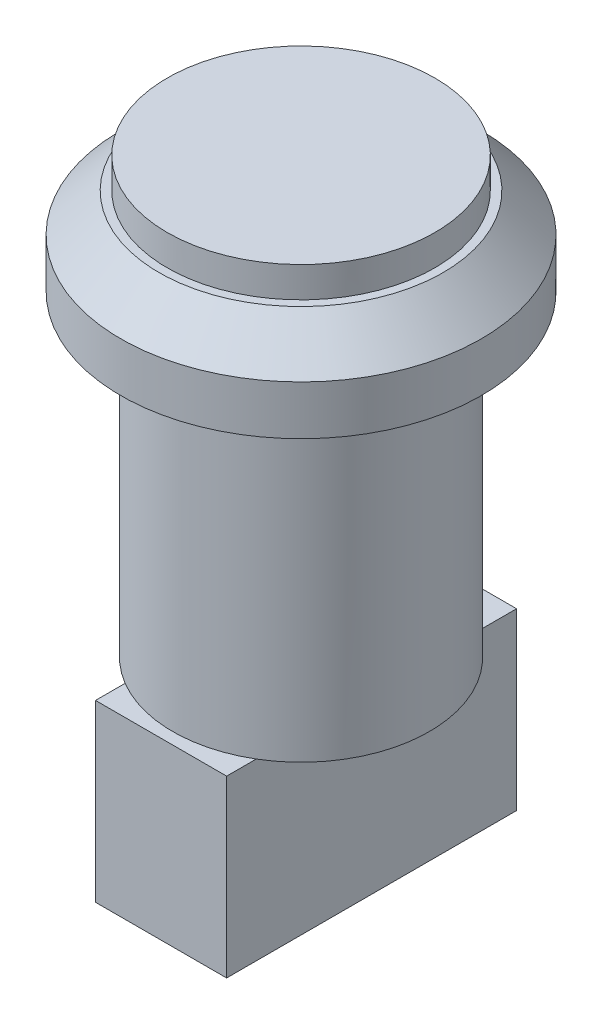
ISO-10303-21;
HEADER;
FILE_DESCRIPTION(('STEP AP214'),'2;1');
FILE_NAME('part.step','',(''),(''),'','','');
FILE_SCHEMA(('AUTOMOTIVE_DESIGN { 1 0 10303 214 1 1 1 1 }'));
ENDSEC;
DATA;
#1=APPLICATION_CONTEXT('core data for automotive mechanical design processes');
#2=APPLICATION_PROTOCOL_DEFINITION('international standard','automotive_design',2000,#1);
#3=PRODUCT_CONTEXT('',#1,'mechanical');
#4=PRODUCT('Part','Part','',(#3));
#5=PRODUCT_RELATED_PRODUCT_CATEGORY('part','',(#4));
#6=PRODUCT_DEFINITION_FORMATION('','',#4);
#7=PRODUCT_DEFINITION_CONTEXT('part definition',#1,'design');
#8=PRODUCT_DEFINITION('design','',#6,#7);
#9=PRODUCT_DEFINITION_SHAPE('','',#8);
#10=(LENGTH_UNIT() NAMED_UNIT(*) SI_UNIT(.MILLI.,.METRE.));
#11=(NAMED_UNIT(*) PLANE_ANGLE_UNIT() SI_UNIT($,.RADIAN.));
#12=(NAMED_UNIT(*) SI_UNIT($,.STERADIAN.) SOLID_ANGLE_UNIT());
#13=UNCERTAINTY_MEASURE_WITH_UNIT(LENGTH_MEASURE(1.E-05),#10,'distance_accuracy_value','');
#14=(GEOMETRIC_REPRESENTATION_CONTEXT(3) GLOBAL_UNCERTAINTY_ASSIGNED_CONTEXT((#13)) GLOBAL_UNIT_ASSIGNED_CONTEXT((#10,
#11,#12)) REPRESENTATION_CONTEXT('',''));
#15=CARTESIAN_POINT('',(0.,0.,0.));
#16=DIRECTION('',(0.,0.,1.));
#17=DIRECTION('',(1.,0.,0.));
#18=AXIS2_PLACEMENT_3D('',#15,#16,#17);
#19=CARTESIAN_POINT('',(0.,-37.,0.));
#20=DIRECTION('',(0.,-1.,0.));
#21=DIRECTION('',(0.,0.,-1.));
#22=AXIS2_PLACEMENT_3D('',#19,#20,#21);
#23=PLANE('',#22);
#24=DIRECTION('',(0.,0.,-1.));
#25=VECTOR('',#24,1.);
#26=CARTESIAN_POINT('',(-6.,-37.,12.8118333096289));
#27=LINE('',#26,#25);
#28=CARTESIAN_POINT('',(-6.,-37.,10.1025986755884));
#29=VERTEX_POINT('',#28);
#30=CARTESIAN_POINT('',(-6.,-37.,-10.1025986755884));
#31=VERTEX_POINT('',#30);
#32=EDGE_CURVE('E11',#29,#31,#27,.T.);
#33=ORIENTED_EDGE('',*,*,#32,.F.);
#34=CARTESIAN_POINT('',(0.,-37.,0.));
#35=DIRECTION('',(0.,-1.,0.));
#36=DIRECTION('',(0.,0.,-1.));
#37=AXIS2_PLACEMENT_3D('',#34,#35,#36);
#38=CIRCLE('',#37,11.75);
#39=EDGE_CURVE('E166',#29,#31,#38,.T.);
#40=ORIENTED_EDGE('',*,*,#39,.T.);
#41=EDGE_LOOP('',(#33,#40));
#42=FACE_BOUND('',#41,.T.);
#43=ADVANCED_FACE('F34',(#42),#23,.T.);
#44=CARTESIAN_POINT('',(0.,2.8,0.));
#45=DIRECTION('',(0.,-1.,0.));
#46=DIRECTION('',(0.,0.,-1.));
#47=AXIS2_PLACEMENT_3D('',#44,#45,#46);
#48=CYLINDRICAL_SURFACE('',#47,12.25);
#49=CARTESIAN_POINT('',(0.,2.8,0.));
#50=DIRECTION('',(0.,1.,0.));
#51=DIRECTION('',(0.,0.,1.));
#52=AXIS2_PLACEMENT_3D('',#49,#50,#51);
#53=CIRCLE('',#52,12.25);
#54=CARTESIAN_POINT('',(0.,2.8,12.25));
#55=VERTEX_POINT('',#54);
#56=EDGE_CURVE('E132',#55,#55,#53,.T.);
#57=ORIENTED_EDGE('',*,*,#56,.F.);
#58=EDGE_LOOP('',(#57));
#59=FACE_BOUND('',#58,.T.);
#60=CARTESIAN_POINT('',(0.,0.,0.));
#61=DIRECTION('',(0.,-1.,0.));
#62=DIRECTION('',(0.,0.,-1.));
#63=AXIS2_PLACEMENT_3D('',#60,#61,#62);
#64=CIRCLE('',#63,12.25);
#65=CARTESIAN_POINT('',(0.,0.,-12.25));
#66=VERTEX_POINT('',#65);
#67=EDGE_CURVE('E129',#66,#66,#64,.T.);
#68=ORIENTED_EDGE('',*,*,#67,.F.);
#69=EDGE_LOOP('',(#68));
#70=FACE_BOUND('',#69,.T.);
#71=ADVANCED_FACE('F181',(#59,#70),#48,.T.);
#72=CARTESIAN_POINT('',(0.,2.8,0.));
#73=DIRECTION('',(0.,1.,0.));
#74=DIRECTION('',(0.,0.,1.));
#75=AXIS2_PLACEMENT_3D('',#72,#73,#74);
#76=PLANE('',#75);
#77=ORIENTED_EDGE('',*,*,#56,.T.);
#78=EDGE_LOOP('',(#77));
#79=FACE_BOUND('',#78,.T.);
#80=ADVANCED_FACE('F186',(#79),#76,.T.);
#81=CARTESIAN_POINT('',(0.,-8.,0.));
#82=DIRECTION('',(0.,1.,0.));
#83=DIRECTION('',(0.,0.,1.));
#84=AXIS2_PLACEMENT_3D('',#81,#82,#83);
#85=CYLINDRICAL_SURFACE('',#84,16.5);
#86=CARTESIAN_POINT('',(0.,-3.5,0.));
#87=DIRECTION('',(0.,-1.,0.));
#88=DIRECTION('',(0.,0.,-1.));
#89=AXIS2_PLACEMENT_3D('',#86,#87,#88);
#90=CIRCLE('',#89,16.5);
#91=CARTESIAN_POINT('',(0.,-3.5,-16.5));
#92=VERTEX_POINT('',#91);
#93=EDGE_CURVE('E134',#92,#92,#90,.T.);
#94=ORIENTED_EDGE('',*,*,#93,.T.);
#95=EDGE_LOOP('',(#94));
#96=FACE_BOUND('',#95,.T.);
#97=CARTESIAN_POINT('',(0.,-8.,0.));
#98=DIRECTION('',(0.,-1.,0.));
#99=DIRECTION('',(0.,0.,-1.));
#100=AXIS2_PLACEMENT_3D('',#97,#98,#99);
#101=CIRCLE('',#100,16.5);
#102=CARTESIAN_POINT('',(0.,-8.,-16.5));
#103=VERTEX_POINT('',#102);
#104=EDGE_CURVE('E124',#103,#103,#101,.T.);
#105=ORIENTED_EDGE('',*,*,#104,.F.);
#106=EDGE_LOOP('',(#105));
#107=FACE_BOUND('',#106,.T.);
#108=ADVANCED_FACE('F202',(#96,#107),#85,.T.);
#109=CARTESIAN_POINT('',(0.,-8.,0.));
#110=DIRECTION('',(0.,-1.,0.));
#111=DIRECTION('',(0.,0.,-1.));
#112=AXIS2_PLACEMENT_3D('',#109,#110,#111);
#113=PLANE('',#112);
#114=CARTESIAN_POINT('',(0.,-8.,0.));
#115=DIRECTION('',(0.,-1.,0.));
#116=DIRECTION('',(0.,0.,-1.));
#117=AXIS2_PLACEMENT_3D('',#114,#115,#116);
#118=CIRCLE('',#117,11.75);
#119=CARTESIAN_POINT('',(0.,-8.,-11.75));
#120=VERTEX_POINT('',#119);
#121=EDGE_CURVE('E115',#120,#120,#118,.T.);
#122=ORIENTED_EDGE('',*,*,#121,.F.);
#123=EDGE_LOOP('',(#122));
#124=FACE_BOUND('',#123,.T.);
#125=ORIENTED_EDGE('',*,*,#104,.T.);
#126=EDGE_LOOP('',(#125));
#127=FACE_BOUND('',#126,.T.);
#128=ADVANCED_FACE('F198',(#124,#127),#113,.T.);
#129=CARTESIAN_POINT('',(0.,0.,0.));
#130=DIRECTION('',(0.,-1.,0.));
#131=DIRECTION('',(0.,0.,-1.));
#132=AXIS2_PLACEMENT_3D('',#129,#130,#131);
#133=PLANE('',#132);
#134=CARTESIAN_POINT('',(0.,0.,0.));
#135=DIRECTION('',(0.,-1.,0.));
#136=DIRECTION('',(0.,0.,-1.));
#137=AXIS2_PLACEMENT_3D('',#134,#135,#136);
#138=CIRCLE('',#137,13.);
#139=CARTESIAN_POINT('',(0.,0.,-13.));
#140=VERTEX_POINT('',#139);
#141=EDGE_CURVE('E38',#140,#140,#138,.F.);
#142=ORIENTED_EDGE('',*,*,#141,.T.);
#143=EDGE_LOOP('',(#142));
#144=FACE_BOUND('',#143,.T.);
#145=ORIENTED_EDGE('',*,*,#67,.T.);
#146=EDGE_LOOP('',(#145));
#147=FACE_BOUND('',#146,.T.);
#148=ADVANCED_FACE('F201',(#144,#147),#133,.F.);
#149=CARTESIAN_POINT('',(0.,-3.5,0.));
#150=DIRECTION('',(0.,-1.,0.));
#151=DIRECTION('',(0.,0.,-1.));
#152=AXIS2_PLACEMENT_3D('',#149,#150,#151);
#153=CONICAL_SURFACE('',#152,16.5,0.78539816339745);
#154=ORIENTED_EDGE('',*,*,#141,.F.);
#155=EDGE_LOOP('',(#154));
#156=FACE_BOUND('',#155,.T.);
#157=ORIENTED_EDGE('',*,*,#93,.F.);
#158=EDGE_LOOP('',(#157));
#159=FACE_BOUND('',#158,.T.);
#160=ADVANCED_FACE('F36',(#156,#159),#153,.T.);
#161=CARTESIAN_POINT('',(0.,-37.,0.));
#162=DIRECTION('',(0.,1.,0.));
#163=DIRECTION('',(0.,0.,1.));
#164=AXIS2_PLACEMENT_3D('',#161,#162,#163);
#165=CYLINDRICAL_SURFACE('',#164,11.75);
#166=CARTESIAN_POINT('',(6.,-37.,-10.1025986755884));
#167=VERTEX_POINT('',#166);
#168=CARTESIAN_POINT('',(6.,-37.,10.1025986755884));
#169=VERTEX_POINT('',#168);
#170=EDGE_CURVE('E123',#167,#169,#38,.T.);
#171=ORIENTED_EDGE('',*,*,#170,.F.);
#172=EDGE_CURVE('E53',#31,#167,#38,.T.);
#173=ORIENTED_EDGE('',*,*,#172,.F.);
#174=ORIENTED_EDGE('',*,*,#39,.F.);
#175=EDGE_CURVE('E125',#169,#29,#38,.T.);
#176=ORIENTED_EDGE('',*,*,#175,.F.);
#177=EDGE_LOOP('',(#171,#173,#174,#176));
#178=FACE_BOUND('',#177,.T.);
#179=ORIENTED_EDGE('',*,*,#121,.T.);
#180=EDGE_LOOP('',(#179));
#181=FACE_BOUND('',#180,.T.);
#182=ADVANCED_FACE('F190',(#178,#181),#165,.T.);
#183=DIRECTION('',(0.,0.,1.));
#184=VECTOR('',#183,1.);
#185=CARTESIAN_POINT('',(6.,-37.,12.8118333096289));
#186=LINE('',#185,#184);
#187=EDGE_CURVE('E43',#167,#169,#186,.T.);
#188=ORIENTED_EDGE('',*,*,#187,.F.);
#189=ORIENTED_EDGE('',*,*,#170,.T.);
#190=EDGE_LOOP('',(#188,#189));
#191=FACE_BOUND('',#190,.T.);
#192=ADVANCED_FACE('F177',(#191),#23,.T.);
#193=CARTESIAN_POINT('',(0.,-37.,0.));
#194=DIRECTION('',(0.,-1.,0.));
#195=DIRECTION('',(0.,0.,-1.));
#196=AXIS2_PLACEMENT_3D('',#193,#194,#195);
#197=PLANE('',#196);
#198=CARTESIAN_POINT('',(6.,-37.,12.8118333096289));
#199=VERTEX_POINT('',#198);
#200=EDGE_CURVE('E144',#169,#199,#186,.T.);
#201=ORIENTED_EDGE('',*,*,#200,.F.);
#202=ORIENTED_EDGE('',*,*,#175,.T.);
#203=CARTESIAN_POINT('',(-6.,-37.,12.8118333096289));
#204=VERTEX_POINT('',#203);
#205=EDGE_CURVE('E45',#204,#29,#27,.T.);
#206=ORIENTED_EDGE('',*,*,#205,.F.);
#207=DIRECTION('',(-1.,0.,0.));
#208=VECTOR('',#207,1.);
#209=CARTESIAN_POINT('',(-6.,-37.,12.8118333096289));
#210=LINE('',#209,#208);
#211=EDGE_CURVE('E109',#199,#204,#210,.T.);
#212=ORIENTED_EDGE('',*,*,#211,.F.);
#213=EDGE_LOOP('',(#201,#202,#206,#212));
#214=FACE_BOUND('',#213,.T.);
#215=ADVANCED_FACE('F164',(#214),#197,.F.);
#216=CARTESIAN_POINT('',(-6.,-37.,-13.7220878964584));
#217=VERTEX_POINT('',#216);
#218=EDGE_CURVE('E46',#31,#217,#27,.T.);
#219=ORIENTED_EDGE('',*,*,#218,.F.);
#220=ORIENTED_EDGE('',*,*,#172,.T.);
#221=CARTESIAN_POINT('',(6.,-37.,-13.7220878964584));
#222=VERTEX_POINT('',#221);
#223=EDGE_CURVE('E143',#222,#167,#186,.T.);
#224=ORIENTED_EDGE('',*,*,#223,.F.);
#225=DIRECTION('',(1.,0.,0.));
#226=VECTOR('',#225,1.);
#227=CARTESIAN_POINT('',(-6.,-37.,-13.7220878964584));
#228=LINE('',#227,#226);
#229=EDGE_CURVE('E149',#217,#222,#228,.T.);
#230=ORIENTED_EDGE('',*,*,#229,.F.);
#231=EDGE_LOOP('',(#219,#220,#224,#230));
#232=FACE_BOUND('',#231,.T.);
#233=ADVANCED_FACE('F169',(#232),#197,.F.);
#234=CARTESIAN_POINT('',(-6.,-53.,12.8118333096289));
#235=DIRECTION('',(1.,0.,0.));
#236=DIRECTION('',(0.,0.,-1.));
#237=AXIS2_PLACEMENT_3D('',#234,#235,#236);
#238=PLANE('',#237);
#239=ORIENTED_EDGE('',*,*,#205,.T.);
#240=ORIENTED_EDGE('',*,*,#32,.T.);
#241=ORIENTED_EDGE('',*,*,#218,.T.);
#242=DIRECTION('',(0.,1.,0.));
#243=VECTOR('',#242,1.);
#244=CARTESIAN_POINT('',(-6.,-53.,-13.7220878964584));
#245=LINE('',#244,#243);
#246=CARTESIAN_POINT('',(-6.,-53.,-13.7220878964584));
#247=VERTEX_POINT('',#246);
#248=EDGE_CURVE('E94',#247,#217,#245,.T.);
#249=ORIENTED_EDGE('',*,*,#248,.F.);
#250=DIRECTION('',(0.,0.,-1.));
#251=VECTOR('',#250,1.);
#252=CARTESIAN_POINT('',(-6.,-53.,12.8118333096289));
#253=LINE('',#252,#251);
#254=CARTESIAN_POINT('',(-6.,-53.,12.8118333096289));
#255=VERTEX_POINT('',#254);
#256=EDGE_CURVE('E100',#255,#247,#253,.T.);
#257=ORIENTED_EDGE('',*,*,#256,.F.);
#258=DIRECTION('',(0.,1.,0.));
#259=VECTOR('',#258,1.);
#260=CARTESIAN_POINT('',(-6.,-53.,12.8118333096289));
#261=LINE('',#260,#259);
#262=EDGE_CURVE('E155',#255,#204,#261,.T.);
#263=ORIENTED_EDGE('',*,*,#262,.T.);
#264=EDGE_LOOP('',(#239,#240,#241,#249,#257,#263));
#265=FACE_BOUND('',#264,.T.);
#266=ADVANCED_FACE('F112',(#265),#238,.F.);
#267=CARTESIAN_POINT('',(-6.,-53.,-13.7220878964584));
#268=DIRECTION('',(0.,0.,1.));
#269=DIRECTION('',(1.,0.,0.));
#270=AXIS2_PLACEMENT_3D('',#267,#268,#269);
#271=PLANE('',#270);
#272=ORIENTED_EDGE('',*,*,#229,.T.);
#273=DIRECTION('',(0.,1.,0.));
#274=VECTOR('',#273,1.);
#275=CARTESIAN_POINT('',(6.,-53.,-13.7220878964584));
#276=LINE('',#275,#274);
#277=CARTESIAN_POINT('',(6.,-53.,-13.7220878964584));
#278=VERTEX_POINT('',#277);
#279=EDGE_CURVE('E96',#278,#222,#276,.T.);
#280=ORIENTED_EDGE('',*,*,#279,.F.);
#281=DIRECTION('',(1.,0.,0.));
#282=VECTOR('',#281,1.);
#283=CARTESIAN_POINT('',(-6.,-53.,-13.7220878964584));
#284=LINE('',#283,#282);
#285=EDGE_CURVE('E90',#247,#278,#284,.T.);
#286=ORIENTED_EDGE('',*,*,#285,.F.);
#287=ORIENTED_EDGE('',*,*,#248,.T.);
#288=EDGE_LOOP('',(#272,#280,#286,#287));
#289=FACE_BOUND('',#288,.T.);
#290=ADVANCED_FACE('F92',(#289),#271,.F.);
#291=CARTESIAN_POINT('',(6.,-53.,12.8118333096289));
#292=DIRECTION('',(-1.,0.,0.));
#293=DIRECTION('',(0.,0.,1.));
#294=AXIS2_PLACEMENT_3D('',#291,#292,#293);
#295=PLANE('',#294);
#296=ORIENTED_EDGE('',*,*,#223,.T.);
#297=ORIENTED_EDGE('',*,*,#187,.T.);
#298=ORIENTED_EDGE('',*,*,#200,.T.);
#299=DIRECTION('',(0.,1.,0.));
#300=VECTOR('',#299,1.);
#301=CARTESIAN_POINT('',(6.,-53.,12.8118333096289));
#302=LINE('',#301,#300);
#303=CARTESIAN_POINT('',(6.,-53.,12.8118333096289));
#304=VERTEX_POINT('',#303);
#305=EDGE_CURVE('E119',#304,#199,#302,.T.);
#306=ORIENTED_EDGE('',*,*,#305,.F.);
#307=DIRECTION('',(0.,0.,1.));
#308=VECTOR('',#307,1.);
#309=CARTESIAN_POINT('',(6.,-53.,12.8118333096289));
#310=LINE('',#309,#308);
#311=EDGE_CURVE('E99',#278,#304,#310,.T.);
#312=ORIENTED_EDGE('',*,*,#311,.F.);
#313=ORIENTED_EDGE('',*,*,#279,.T.);
#314=EDGE_LOOP('',(#296,#297,#298,#306,#312,#313));
#315=FACE_BOUND('',#314,.T.);
#316=ADVANCED_FACE('F156',(#315),#295,.F.);
#317=CARTESIAN_POINT('',(-6.,-53.,12.8118333096289));
#318=DIRECTION('',(0.,0.,-1.));
#319=DIRECTION('',(-1.,0.,0.));
#320=AXIS2_PLACEMENT_3D('',#317,#318,#319);
#321=PLANE('',#320);
#322=ORIENTED_EDGE('',*,*,#211,.T.);
#323=ORIENTED_EDGE('',*,*,#262,.F.);
#324=DIRECTION('',(-1.,0.,0.));
#325=VECTOR('',#324,1.);
#326=CARTESIAN_POINT('',(-6.,-53.,12.8118333096289));
#327=LINE('',#326,#325);
#328=EDGE_CURVE('E105',#304,#255,#327,.T.);
#329=ORIENTED_EDGE('',*,*,#328,.F.);
#330=ORIENTED_EDGE('',*,*,#305,.T.);
#331=EDGE_LOOP('',(#322,#323,#329,#330));
#332=FACE_BOUND('',#331,.T.);
#333=ADVANCED_FACE('F159',(#332),#321,.F.);
#334=CARTESIAN_POINT('',(0.,-53.,0.));
#335=DIRECTION('',(0.,-1.,0.));
#336=DIRECTION('',(0.,0.,-1.));
#337=AXIS2_PLACEMENT_3D('',#334,#335,#336);
#338=PLANE('',#337);
#339=ORIENTED_EDGE('',*,*,#256,.T.);
#340=ORIENTED_EDGE('',*,*,#285,.T.);
#341=ORIENTED_EDGE('',*,*,#311,.T.);
#342=ORIENTED_EDGE('',*,*,#328,.T.);
#343=EDGE_LOOP('',(#339,#340,#341,#342));
#344=FACE_BOUND('',#343,.T.);
#345=ADVANCED_FACE('F103',(#344),#338,.T.);
#346=CLOSED_SHELL('',(#43,#71,#80,#108,#128,#148,#160,#182,#192,#215,#233,#266,#290,#316,#333,#345));
#347=MANIFOLD_SOLID_BREP('B2',#346);
#348=ADVANCED_BREP_SHAPE_REPRESENTATION('',(#18,#347),#14);
#349=SHAPE_DEFINITION_REPRESENTATION(#9,#348);
ENDSEC;
END-ISO-10303-21;
